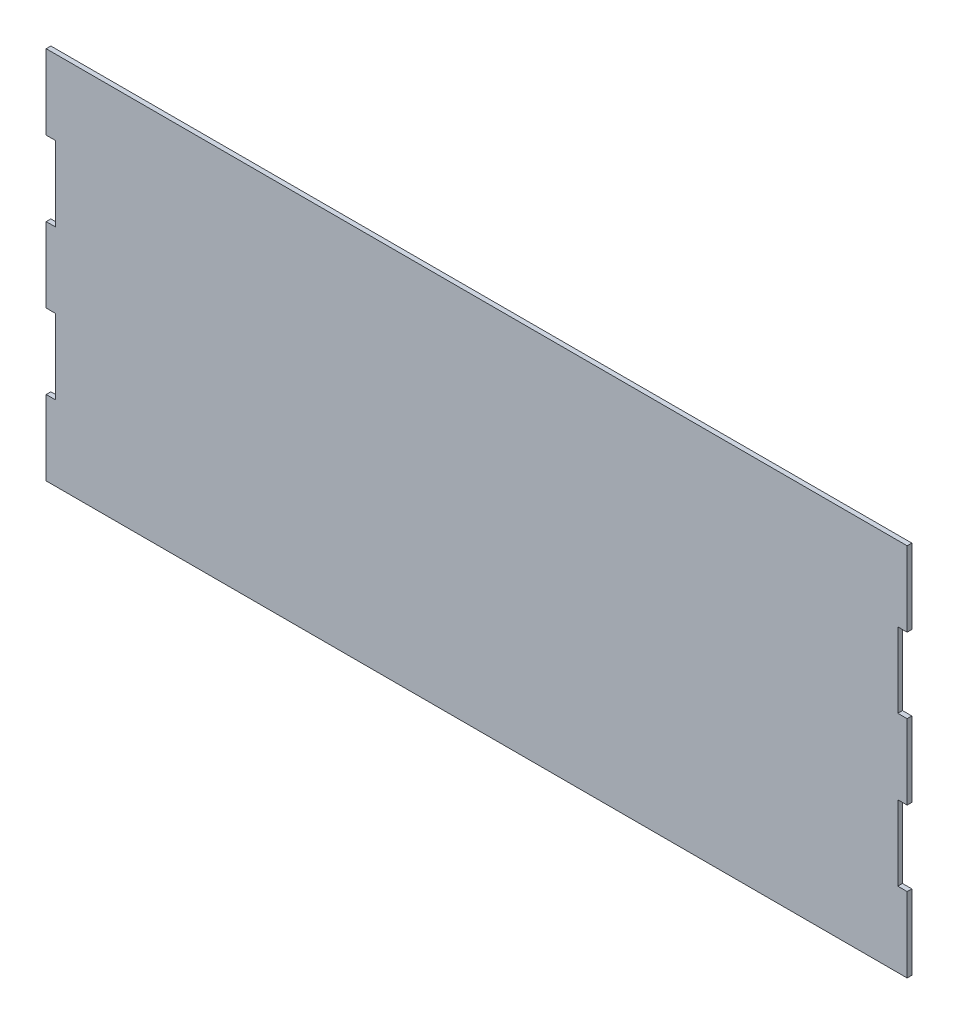
ISO-10303-21;
HEADER;
FILE_DESCRIPTION(('STEP AP214'),'2;1');
FILE_NAME('part.step','',(''),(''),'','','');
FILE_SCHEMA(('AUTOMOTIVE_DESIGN { 1 0 10303 214 1 1 1 1 }'));
ENDSEC;
DATA;
#1=APPLICATION_CONTEXT('core data for automotive mechanical design processes');
#2=APPLICATION_PROTOCOL_DEFINITION('international standard','automotive_design',2000,#1);
#3=PRODUCT_CONTEXT('',#1,'mechanical');
#4=PRODUCT('Part','Part','',(#3));
#5=PRODUCT_RELATED_PRODUCT_CATEGORY('part','',(#4));
#6=PRODUCT_DEFINITION_FORMATION('','',#4);
#7=PRODUCT_DEFINITION_CONTEXT('part definition',#1,'design');
#8=PRODUCT_DEFINITION('design','',#6,#7);
#9=PRODUCT_DEFINITION_SHAPE('','',#8);
#10=(LENGTH_UNIT() NAMED_UNIT(*) SI_UNIT(.MILLI.,.METRE.));
#11=(NAMED_UNIT(*) PLANE_ANGLE_UNIT() SI_UNIT($,.RADIAN.));
#12=(NAMED_UNIT(*) SI_UNIT($,.STERADIAN.) SOLID_ANGLE_UNIT());
#13=UNCERTAINTY_MEASURE_WITH_UNIT(LENGTH_MEASURE(1.E-05),#10,'distance_accuracy_value','');
#14=(GEOMETRIC_REPRESENTATION_CONTEXT(3) GLOBAL_UNCERTAINTY_ASSIGNED_CONTEXT((#13)) GLOBAL_UNIT_ASSIGNED_CONTEXT((#10,
#11,#12)) REPRESENTATION_CONTEXT('',''));
#15=CARTESIAN_POINT('',(0.,0.,0.));
#16=DIRECTION('',(0.,0.,1.));
#17=DIRECTION('',(1.,0.,0.));
#18=AXIS2_PLACEMENT_3D('',#15,#16,#17);
#19=CARTESIAN_POINT('',(0.,101.6,3.175));
#20=DIRECTION('',(0.,-1.,0.));
#21=DIRECTION('',(0.,0.,-1.));
#22=AXIS2_PLACEMENT_3D('',#19,#20,#21);
#23=PLANE('',#22);
#24=DIRECTION('',(-1.,0.,0.));
#25=VECTOR('',#24,1.);
#26=CARTESIAN_POINT('',(0.,101.6,0.));
#27=LINE('',#26,#25);
#28=CARTESIAN_POINT('',(584.199999999999,101.6,0.));
#29=VERTEX_POINT('',#28);
#30=CARTESIAN_POINT('',(577.849999999999,101.6,0.));
#31=VERTEX_POINT('',#30);
#32=EDGE_CURVE('E203',#29,#31,#27,.T.);
#33=ORIENTED_EDGE('',*,*,#32,.F.);
#34=DIRECTION('',(0.,0.,-1.));
#35=VECTOR('',#34,1.);
#36=CARTESIAN_POINT('',(584.199999999999,101.6,3.175));
#37=LINE('',#36,#35);
#38=CARTESIAN_POINT('',(584.199999999999,101.6,3.175));
#39=VERTEX_POINT('',#38);
#40=EDGE_CURVE('E11',#39,#29,#37,.T.);
#41=ORIENTED_EDGE('',*,*,#40,.F.);
#42=DIRECTION('',(-1.,0.,0.));
#43=VECTOR('',#42,1.);
#44=CARTESIAN_POINT('',(0.,101.6,3.175));
#45=LINE('',#44,#43);
#46=CARTESIAN_POINT('',(577.849999999999,101.6,3.175));
#47=VERTEX_POINT('',#46);
#48=EDGE_CURVE('E254',#39,#47,#45,.T.);
#49=ORIENTED_EDGE('',*,*,#48,.T.);
#50=DIRECTION('',(0.,0.,-1.));
#51=VECTOR('',#50,1.);
#52=CARTESIAN_POINT('',(577.849999999999,101.6,3.175));
#53=LINE('',#52,#51);
#54=EDGE_CURVE('E52',#47,#31,#53,.T.);
#55=ORIENTED_EDGE('',*,*,#54,.T.);
#56=EDGE_LOOP('',(#33,#41,#49,#55));
#57=FACE_BOUND('',#56,.T.);
#58=ADVANCED_FACE('F36',(#57),#23,.T.);
#59=CARTESIAN_POINT('',(584.199999999997,-1.14908083048703E-11,3.175));
#60=DIRECTION('',(-1.,0.,0.));
#61=DIRECTION('',(0.,-1.,0.));
#62=AXIS2_PLACEMENT_3D('',#59,#60,#61);
#63=PLANE('',#62);
#64=DIRECTION('',(0.,1.,0.));
#65=VECTOR('',#64,1.);
#66=CARTESIAN_POINT('',(584.199999999997,-1.14908083048703E-11,0.));
#67=LINE('',#66,#65);
#68=CARTESIAN_POINT('',(584.2,152.4,0.));
#69=VERTEX_POINT('',#68);
#70=EDGE_CURVE('E205',#29,#69,#67,.T.);
#71=ORIENTED_EDGE('',*,*,#70,.T.);
#72=DIRECTION('',(0.,0.,-1.));
#73=VECTOR('',#72,1.);
#74=CARTESIAN_POINT('',(584.2,152.4,3.175));
#75=LINE('',#74,#73);
#76=CARTESIAN_POINT('',(584.2,152.4,3.175));
#77=VERTEX_POINT('',#76);
#78=EDGE_CURVE('E44',#77,#69,#75,.T.);
#79=ORIENTED_EDGE('',*,*,#78,.F.);
#80=DIRECTION('',(0.,1.,0.));
#81=VECTOR('',#80,1.);
#82=CARTESIAN_POINT('',(584.199999999997,-1.14908083048703E-11,3.175));
#83=LINE('',#82,#81);
#84=EDGE_CURVE('E311',#39,#77,#83,.T.);
#85=ORIENTED_EDGE('',*,*,#84,.F.);
#86=ORIENTED_EDGE('',*,*,#40,.T.);
#87=EDGE_LOOP('',(#71,#79,#85,#86));
#88=FACE_BOUND('',#87,.T.);
#89=ADVANCED_FACE('F298',(#88),#63,.F.);
#90=CARTESIAN_POINT('',(0.,152.4,3.175));
#91=DIRECTION('',(0.,1.,0.));
#92=DIRECTION('',(0.,0.,1.));
#93=AXIS2_PLACEMENT_3D('',#90,#91,#92);
#94=PLANE('',#93);
#95=DIRECTION('',(1.,0.,0.));
#96=VECTOR('',#95,1.);
#97=CARTESIAN_POINT('',(0.,152.4,0.));
#98=LINE('',#97,#96);
#99=CARTESIAN_POINT('',(577.85,152.4,0.));
#100=VERTEX_POINT('',#99);
#101=EDGE_CURVE('E208',#100,#69,#98,.T.);
#102=ORIENTED_EDGE('',*,*,#101,.F.);
#103=DIRECTION('',(0.,0.,-1.));
#104=VECTOR('',#103,1.);
#105=CARTESIAN_POINT('',(577.85,152.4,3.175));
#106=LINE('',#105,#104);
#107=CARTESIAN_POINT('',(577.85,152.4,3.175));
#108=VERTEX_POINT('',#107);
#109=EDGE_CURVE('E288',#108,#100,#106,.T.);
#110=ORIENTED_EDGE('',*,*,#109,.F.);
#111=DIRECTION('',(1.,0.,0.));
#112=VECTOR('',#111,1.);
#113=CARTESIAN_POINT('',(0.,152.4,3.175));
#114=LINE('',#113,#112);
#115=EDGE_CURVE('E295',#108,#77,#114,.T.);
#116=ORIENTED_EDGE('',*,*,#115,.T.);
#117=ORIENTED_EDGE('',*,*,#78,.T.);
#118=EDGE_LOOP('',(#102,#110,#116,#117));
#119=FACE_BOUND('',#118,.T.);
#120=ADVANCED_FACE('F293',(#119),#94,.T.);
#121=CARTESIAN_POINT('',(577.85,0.,3.175));
#122=DIRECTION('',(1.,0.,0.));
#123=DIRECTION('',(0.,0.,-1.));
#124=AXIS2_PLACEMENT_3D('',#121,#122,#123);
#125=PLANE('',#124);
#126=DIRECTION('',(0.,-1.,0.));
#127=VECTOR('',#126,1.);
#128=CARTESIAN_POINT('',(577.85,0.,0.));
#129=LINE('',#128,#127);
#130=CARTESIAN_POINT('',(577.85,203.2,0.));
#131=VERTEX_POINT('',#130);
#132=EDGE_CURVE('E211',#131,#100,#129,.T.);
#133=ORIENTED_EDGE('',*,*,#132,.F.);
#134=DIRECTION('',(0.,0.,-1.));
#135=VECTOR('',#134,1.);
#136=CARTESIAN_POINT('',(577.85,203.2,3.175));
#137=LINE('',#136,#135);
#138=CARTESIAN_POINT('',(577.85,203.2,3.175));
#139=VERTEX_POINT('',#138);
#140=EDGE_CURVE('E286',#139,#131,#137,.T.);
#141=ORIENTED_EDGE('',*,*,#140,.F.);
#142=DIRECTION('',(0.,-1.,0.));
#143=VECTOR('',#142,1.);
#144=CARTESIAN_POINT('',(577.85,0.,3.175));
#145=LINE('',#144,#143);
#146=EDGE_CURVE('E308',#139,#108,#145,.T.);
#147=ORIENTED_EDGE('',*,*,#146,.T.);
#148=ORIENTED_EDGE('',*,*,#109,.T.);
#149=EDGE_LOOP('',(#133,#141,#147,#148));
#150=FACE_BOUND('',#149,.T.);
#151=ADVANCED_FACE('F305',(#150),#125,.T.);
#152=CARTESIAN_POINT('',(0.,203.2,3.175));
#153=DIRECTION('',(0.,-1.,0.));
#154=DIRECTION('',(0.,0.,-1.));
#155=AXIS2_PLACEMENT_3D('',#152,#153,#154);
#156=PLANE('',#155);
#157=DIRECTION('',(-1.,0.,0.));
#158=VECTOR('',#157,1.);
#159=CARTESIAN_POINT('',(0.,203.2,0.));
#160=LINE('',#159,#158);
#161=CARTESIAN_POINT('',(584.2,203.2,0.));
#162=VERTEX_POINT('',#161);
#163=EDGE_CURVE('E214',#162,#131,#160,.T.);
#164=ORIENTED_EDGE('',*,*,#163,.F.);
#165=DIRECTION('',(0.,0.,-1.));
#166=VECTOR('',#165,1.);
#167=CARTESIAN_POINT('',(584.2,203.2,3.175));
#168=LINE('',#167,#166);
#169=CARTESIAN_POINT('',(584.2,203.2,3.175));
#170=VERTEX_POINT('',#169);
#171=EDGE_CURVE('E284',#170,#162,#168,.T.);
#172=ORIENTED_EDGE('',*,*,#171,.F.);
#173=DIRECTION('',(-1.,0.,0.));
#174=VECTOR('',#173,1.);
#175=CARTESIAN_POINT('',(0.,203.2,3.175));
#176=LINE('',#175,#174);
#177=EDGE_CURVE('E313',#170,#139,#176,.T.);
#178=ORIENTED_EDGE('',*,*,#177,.T.);
#179=ORIENTED_EDGE('',*,*,#140,.T.);
#180=EDGE_LOOP('',(#164,#172,#178,#179));
#181=FACE_BOUND('',#180,.T.);
#182=ADVANCED_FACE('F512',(#181),#156,.T.);
#183=CARTESIAN_POINT('',(584.2,0.,3.175));
#184=DIRECTION('',(-1.,0.,0.));
#185=DIRECTION('',(0.,0.,1.));
#186=AXIS2_PLACEMENT_3D('',#183,#184,#185);
#187=PLANE('',#186);
#188=DIRECTION('',(0.,1.,0.));
#189=VECTOR('',#188,1.);
#190=CARTESIAN_POINT('',(584.2,0.,0.));
#191=LINE('',#190,#189);
#192=CARTESIAN_POINT('',(584.2,254.,0.));
#193=VERTEX_POINT('',#192);
#194=EDGE_CURVE('E217',#162,#193,#191,.T.);
#195=ORIENTED_EDGE('',*,*,#194,.T.);
#196=DIRECTION('',(0.,0.,-1.));
#197=VECTOR('',#196,1.);
#198=CARTESIAN_POINT('',(584.2,254.,3.175));
#199=LINE('',#198,#197);
#200=CARTESIAN_POINT('',(584.2,254.,3.175));
#201=VERTEX_POINT('',#200);
#202=EDGE_CURVE('E282',#201,#193,#199,.T.);
#203=ORIENTED_EDGE('',*,*,#202,.F.);
#204=DIRECTION('',(0.,1.,0.));
#205=VECTOR('',#204,1.);
#206=CARTESIAN_POINT('',(584.2,0.,3.175));
#207=LINE('',#206,#205);
#208=EDGE_CURVE('E319',#170,#201,#207,.T.);
#209=ORIENTED_EDGE('',*,*,#208,.F.);
#210=ORIENTED_EDGE('',*,*,#171,.T.);
#211=EDGE_LOOP('',(#195,#203,#209,#210));
#212=FACE_BOUND('',#211,.T.);
#213=ADVANCED_FACE('F502',(#212),#187,.F.);
#214=CARTESIAN_POINT('',(0.,254.,3.175));
#215=DIRECTION('',(0.,1.,0.));
#216=DIRECTION('',(-1.,0.,0.));
#217=AXIS2_PLACEMENT_3D('',#214,#215,#216);
#218=PLANE('',#217);
#219=DIRECTION('',(1.,0.,0.));
#220=VECTOR('',#219,1.);
#221=CARTESIAN_POINT('',(0.,254.,0.));
#222=LINE('',#221,#220);
#223=CARTESIAN_POINT('',(0.,254.,0.));
#224=VERTEX_POINT('',#223);
#225=EDGE_CURVE('E220',#224,#193,#222,.T.);
#226=ORIENTED_EDGE('',*,*,#225,.F.);
#227=DIRECTION('',(0.,0.,-1.));
#228=VECTOR('',#227,1.);
#229=CARTESIAN_POINT('',(0.,254.,3.175));
#230=LINE('',#229,#228);
#231=CARTESIAN_POINT('',(0.,254.,3.175));
#232=VERTEX_POINT('',#231);
#233=EDGE_CURVE('E280',#232,#224,#230,.T.);
#234=ORIENTED_EDGE('',*,*,#233,.F.);
#235=DIRECTION('',(1.,0.,0.));
#236=VECTOR('',#235,1.);
#237=CARTESIAN_POINT('',(0.,254.,3.175));
#238=LINE('',#237,#236);
#239=EDGE_CURVE('E321',#232,#201,#238,.T.);
#240=ORIENTED_EDGE('',*,*,#239,.T.);
#241=ORIENTED_EDGE('',*,*,#202,.T.);
#242=EDGE_LOOP('',(#226,#234,#240,#241));
#243=FACE_BOUND('',#242,.T.);
#244=ADVANCED_FACE('F492',(#243),#218,.T.);
#245=CARTESIAN_POINT('',(0.,0.,3.175));
#246=DIRECTION('',(-1.,0.,0.));
#247=DIRECTION('',(0.,0.,1.));
#248=AXIS2_PLACEMENT_3D('',#245,#246,#247);
#249=PLANE('',#248);
#250=DIRECTION('',(0.,1.,0.));
#251=VECTOR('',#250,1.);
#252=CARTESIAN_POINT('',(0.,0.,0.));
#253=LINE('',#252,#251);
#254=CARTESIAN_POINT('',(0.,203.2,0.));
#255=VERTEX_POINT('',#254);
#256=EDGE_CURVE('E223',#255,#224,#253,.T.);
#257=ORIENTED_EDGE('',*,*,#256,.F.);
#258=DIRECTION('',(0.,0.,-1.));
#259=VECTOR('',#258,1.);
#260=CARTESIAN_POINT('',(0.,203.2,3.175));
#261=LINE('',#260,#259);
#262=CARTESIAN_POINT('',(0.,203.2,3.175));
#263=VERTEX_POINT('',#262);
#264=EDGE_CURVE('E278',#263,#255,#261,.T.);
#265=ORIENTED_EDGE('',*,*,#264,.F.);
#266=DIRECTION('',(0.,1.,0.));
#267=VECTOR('',#266,1.);
#268=CARTESIAN_POINT('',(0.,0.,3.175));
#269=LINE('',#268,#267);
#270=EDGE_CURVE('E324',#263,#232,#269,.T.);
#271=ORIENTED_EDGE('',*,*,#270,.T.);
#272=ORIENTED_EDGE('',*,*,#233,.T.);
#273=EDGE_LOOP('',(#257,#265,#271,#272));
#274=FACE_BOUND('',#273,.T.);
#275=ADVANCED_FACE('F482',(#274),#249,.T.);
#276=CARTESIAN_POINT('',(0.,203.2,3.175));
#277=DIRECTION('',(0.,1.,0.));
#278=DIRECTION('',(0.,0.,1.));
#279=AXIS2_PLACEMENT_3D('',#276,#277,#278);
#280=PLANE('',#279);
#281=DIRECTION('',(1.,0.,0.));
#282=VECTOR('',#281,1.);
#283=CARTESIAN_POINT('',(0.,203.2,0.));
#284=LINE('',#283,#282);
#285=CARTESIAN_POINT('',(6.35,203.2,0.));
#286=VERTEX_POINT('',#285);
#287=EDGE_CURVE('E226',#255,#286,#284,.T.);
#288=ORIENTED_EDGE('',*,*,#287,.T.);
#289=DIRECTION('',(0.,0.,-1.));
#290=VECTOR('',#289,1.);
#291=CARTESIAN_POINT('',(6.35,203.2,3.175));
#292=LINE('',#291,#290);
#293=CARTESIAN_POINT('',(6.35,203.2,3.175));
#294=VERTEX_POINT('',#293);
#295=EDGE_CURVE('E275',#294,#286,#292,.T.);
#296=ORIENTED_EDGE('',*,*,#295,.F.);
#297=DIRECTION('',(1.,0.,0.));
#298=VECTOR('',#297,1.);
#299=CARTESIAN_POINT('',(0.,203.2,3.175));
#300=LINE('',#299,#298);
#301=EDGE_CURVE('E327',#263,#294,#300,.T.);
#302=ORIENTED_EDGE('',*,*,#301,.F.);
#303=ORIENTED_EDGE('',*,*,#264,.T.);
#304=EDGE_LOOP('',(#288,#296,#302,#303));
#305=FACE_BOUND('',#304,.T.);
#306=ADVANCED_FACE('F472',(#305),#280,.F.);
#307=CARTESIAN_POINT('',(6.35000000000002,0.,3.175));
#308=DIRECTION('',(1.,0.,0.));
#309=DIRECTION('',(0.,1.,0.));
#310=AXIS2_PLACEMENT_3D('',#307,#308,#309);
#311=PLANE('',#310);
#312=DIRECTION('',(0.,-1.,0.));
#313=VECTOR('',#312,1.);
#314=CARTESIAN_POINT('',(6.35000000000002,0.,0.));
#315=LINE('',#314,#313);
#316=CARTESIAN_POINT('',(6.35,152.4,0.));
#317=VERTEX_POINT('',#316);
#318=EDGE_CURVE('E228',#286,#317,#315,.T.);
#319=ORIENTED_EDGE('',*,*,#318,.T.);
#320=DIRECTION('',(0.,0.,-1.));
#321=VECTOR('',#320,1.);
#322=CARTESIAN_POINT('',(6.35,152.4,3.175));
#323=LINE('',#322,#321);
#324=CARTESIAN_POINT('',(6.35,152.4,3.175));
#325=VERTEX_POINT('',#324);
#326=EDGE_CURVE('E272',#325,#317,#323,.T.);
#327=ORIENTED_EDGE('',*,*,#326,.F.);
#328=DIRECTION('',(0.,-1.,0.));
#329=VECTOR('',#328,1.);
#330=CARTESIAN_POINT('',(6.35000000000002,0.,3.175));
#331=LINE('',#330,#329);
#332=EDGE_CURVE('E329',#294,#325,#331,.T.);
#333=ORIENTED_EDGE('',*,*,#332,.F.);
#334=ORIENTED_EDGE('',*,*,#295,.T.);
#335=EDGE_LOOP('',(#319,#327,#333,#334));
#336=FACE_BOUND('',#335,.T.);
#337=ADVANCED_FACE('F462',(#336),#311,.F.);
#338=CARTESIAN_POINT('',(0.,152.4,3.175));
#339=DIRECTION('',(0.,-1.,0.));
#340=DIRECTION('',(0.,0.,-1.));
#341=AXIS2_PLACEMENT_3D('',#338,#339,#340);
#342=PLANE('',#341);
#343=DIRECTION('',(-1.,0.,0.));
#344=VECTOR('',#343,1.);
#345=CARTESIAN_POINT('',(0.,152.4,0.));
#346=LINE('',#345,#344);
#347=CARTESIAN_POINT('',(0.,152.4,0.));
#348=VERTEX_POINT('',#347);
#349=EDGE_CURVE('E230',#317,#348,#346,.T.);
#350=ORIENTED_EDGE('',*,*,#349,.T.);
#351=DIRECTION('',(0.,0.,-1.));
#352=VECTOR('',#351,1.);
#353=CARTESIAN_POINT('',(0.,152.4,3.175));
#354=LINE('',#353,#352);
#355=CARTESIAN_POINT('',(0.,152.4,3.175));
#356=VERTEX_POINT('',#355);
#357=EDGE_CURVE('E270',#356,#348,#354,.T.);
#358=ORIENTED_EDGE('',*,*,#357,.F.);
#359=DIRECTION('',(-1.,0.,0.));
#360=VECTOR('',#359,1.);
#361=CARTESIAN_POINT('',(0.,152.4,3.175));
#362=LINE('',#361,#360);
#363=EDGE_CURVE('E331',#325,#356,#362,.T.);
#364=ORIENTED_EDGE('',*,*,#363,.F.);
#365=ORIENTED_EDGE('',*,*,#326,.T.);
#366=EDGE_LOOP('',(#350,#358,#364,#365));
#367=FACE_BOUND('',#366,.T.);
#368=ADVANCED_FACE('F452',(#367),#342,.F.);
#369=CARTESIAN_POINT('',(3.19261053623816E-12,0.,3.175));
#370=DIRECTION('',(-1.,0.,0.));
#371=DIRECTION('',(0.,-1.,0.));
#372=AXIS2_PLACEMENT_3D('',#369,#370,#371);
#373=PLANE('',#372);
#374=DIRECTION('',(0.,1.,0.));
#375=VECTOR('',#374,1.);
#376=CARTESIAN_POINT('',(3.19261053623816E-12,0.,0.));
#377=LINE('',#376,#375);
#378=CARTESIAN_POINT('',(1.06420351284259E-12,101.6,0.));
#379=VERTEX_POINT('',#378);
#380=EDGE_CURVE('E233',#379,#348,#377,.T.);
#381=ORIENTED_EDGE('',*,*,#380,.F.);
#382=DIRECTION('',(0.,0.,-1.));
#383=VECTOR('',#382,1.);
#384=CARTESIAN_POINT('',(1.06420351284259E-12,101.6,3.175));
#385=LINE('',#384,#383);
#386=CARTESIAN_POINT('',(1.06420351284259E-12,101.6,3.175));
#387=VERTEX_POINT('',#386);
#388=EDGE_CURVE('E268',#387,#379,#385,.T.);
#389=ORIENTED_EDGE('',*,*,#388,.F.);
#390=DIRECTION('',(0.,1.,0.));
#391=VECTOR('',#390,1.);
#392=CARTESIAN_POINT('',(3.19261053623816E-12,0.,3.175));
#393=LINE('',#392,#391);
#394=EDGE_CURVE('E333',#387,#356,#393,.T.);
#395=ORIENTED_EDGE('',*,*,#394,.T.);
#396=ORIENTED_EDGE('',*,*,#357,.T.);
#397=EDGE_LOOP('',(#381,#389,#395,#396));
#398=FACE_BOUND('',#397,.T.);
#399=ADVANCED_FACE('F442',(#398),#373,.T.);
#400=CARTESIAN_POINT('',(0.,101.6,3.175));
#401=DIRECTION('',(0.,1.,0.));
#402=DIRECTION('',(0.,0.,1.));
#403=AXIS2_PLACEMENT_3D('',#400,#401,#402);
#404=PLANE('',#403);
#405=DIRECTION('',(1.,0.,0.));
#406=VECTOR('',#405,1.);
#407=CARTESIAN_POINT('',(0.,101.6,0.));
#408=LINE('',#407,#406);
#409=CARTESIAN_POINT('',(6.35000000000106,101.6,0.));
#410=VERTEX_POINT('',#409);
#411=EDGE_CURVE('E236',#379,#410,#408,.T.);
#412=ORIENTED_EDGE('',*,*,#411,.T.);
#413=DIRECTION('',(0.,0.,-1.));
#414=VECTOR('',#413,1.);
#415=CARTESIAN_POINT('',(6.35000000000106,101.6,3.175));
#416=LINE('',#415,#414);
#417=CARTESIAN_POINT('',(6.35000000000106,101.6,3.175));
#418=VERTEX_POINT('',#417);
#419=EDGE_CURVE('E265',#418,#410,#416,.T.);
#420=ORIENTED_EDGE('',*,*,#419,.F.);
#421=DIRECTION('',(1.,0.,0.));
#422=VECTOR('',#421,1.);
#423=CARTESIAN_POINT('',(0.,101.6,3.175));
#424=LINE('',#423,#422);
#425=EDGE_CURVE('E336',#387,#418,#424,.T.);
#426=ORIENTED_EDGE('',*,*,#425,.F.);
#427=ORIENTED_EDGE('',*,*,#388,.T.);
#428=EDGE_LOOP('',(#412,#420,#426,#427));
#429=FACE_BOUND('',#428,.T.);
#430=ADVANCED_FACE('F432',(#429),#404,.F.);
#431=CARTESIAN_POINT('',(6.35000000000107,0.,3.175));
#432=DIRECTION('',(1.,0.,0.));
#433=DIRECTION('',(0.,1.,0.));
#434=AXIS2_PLACEMENT_3D('',#431,#432,#433);
#435=PLANE('',#434);
#436=DIRECTION('',(0.,-1.,0.));
#437=VECTOR('',#436,1.);
#438=CARTESIAN_POINT('',(6.35000000000107,0.,0.));
#439=LINE('',#438,#437);
#440=CARTESIAN_POINT('',(6.35000000000107,50.8,0.));
#441=VERTEX_POINT('',#440);
#442=EDGE_CURVE('E238',#410,#441,#439,.T.);
#443=ORIENTED_EDGE('',*,*,#442,.T.);
#444=DIRECTION('',(0.,0.,-1.));
#445=VECTOR('',#444,1.);
#446=CARTESIAN_POINT('',(6.35000000000107,50.8,3.175));
#447=LINE('',#446,#445);
#448=CARTESIAN_POINT('',(6.35000000000107,50.8,3.175));
#449=VERTEX_POINT('',#448);
#450=EDGE_CURVE('E262',#449,#441,#447,.T.);
#451=ORIENTED_EDGE('',*,*,#450,.F.);
#452=DIRECTION('',(0.,-1.,0.));
#453=VECTOR('',#452,1.);
#454=CARTESIAN_POINT('',(6.35000000000107,0.,3.175));
#455=LINE('',#454,#453);
#456=EDGE_CURVE('E338',#418,#449,#455,.T.);
#457=ORIENTED_EDGE('',*,*,#456,.F.);
#458=ORIENTED_EDGE('',*,*,#419,.T.);
#459=EDGE_LOOP('',(#443,#451,#457,#458));
#460=FACE_BOUND('',#459,.T.);
#461=ADVANCED_FACE('F423',(#460),#435,.F.);
#462=CARTESIAN_POINT('',(0.,50.8,3.175));
#463=DIRECTION('',(0.,-1.,0.));
#464=DIRECTION('',(0.,0.,-1.));
#465=AXIS2_PLACEMENT_3D('',#462,#463,#464);
#466=PLANE('',#465);
#467=DIRECTION('',(-1.,0.,0.));
#468=VECTOR('',#467,1.);
#469=CARTESIAN_POINT('',(0.,50.8,0.));
#470=LINE('',#469,#468);
#471=CARTESIAN_POINT('',(1.06420351207939E-12,50.8,0.));
#472=VERTEX_POINT('',#471);
#473=EDGE_CURVE('E240',#441,#472,#470,.T.);
#474=ORIENTED_EDGE('',*,*,#473,.T.);
#475=DIRECTION('',(0.,0.,-1.));
#476=VECTOR('',#475,1.);
#477=CARTESIAN_POINT('',(1.06420351207939E-12,50.8,3.175));
#478=LINE('',#477,#476);
#479=CARTESIAN_POINT('',(1.06420351207939E-12,50.8,3.175));
#480=VERTEX_POINT('',#479);
#481=EDGE_CURVE('E260',#480,#472,#478,.T.);
#482=ORIENTED_EDGE('',*,*,#481,.F.);
#483=DIRECTION('',(-1.,0.,0.));
#484=VECTOR('',#483,1.);
#485=CARTESIAN_POINT('',(0.,50.8,3.175));
#486=LINE('',#485,#484);
#487=EDGE_CURVE('E340',#449,#480,#486,.T.);
#488=ORIENTED_EDGE('',*,*,#487,.F.);
#489=ORIENTED_EDGE('',*,*,#450,.T.);
#490=EDGE_LOOP('',(#474,#482,#488,#489));
#491=FACE_BOUND('',#490,.T.);
#492=ADVANCED_FACE('F352',(#491),#466,.F.);
#493=CARTESIAN_POINT('',(0.,0.,3.175));
#494=DIRECTION('',(-1.,0.,0.));
#495=DIRECTION('',(0.,-1.,0.));
#496=AXIS2_PLACEMENT_3D('',#493,#494,#495);
#497=PLANE('',#496);
#498=DIRECTION('',(0.,1.,0.));
#499=VECTOR('',#498,1.);
#500=CARTESIAN_POINT('',(0.,0.,0.));
#501=LINE('',#500,#499);
#502=CARTESIAN_POINT('',(0.,0.,0.));
#503=VERTEX_POINT('',#502);
#504=EDGE_CURVE('E243',#503,#472,#501,.T.);
#505=ORIENTED_EDGE('',*,*,#504,.F.);
#506=DIRECTION('',(0.,0.,-1.));
#507=VECTOR('',#506,1.);
#508=CARTESIAN_POINT('',(0.,0.,3.175));
#509=LINE('',#508,#507);
#510=CARTESIAN_POINT('',(0.,0.,3.175));
#511=VERTEX_POINT('',#510);
#512=EDGE_CURVE('E258',#511,#503,#509,.T.);
#513=ORIENTED_EDGE('',*,*,#512,.F.);
#514=DIRECTION('',(0.,1.,0.));
#515=VECTOR('',#514,1.);
#516=CARTESIAN_POINT('',(0.,0.,3.175));
#517=LINE('',#516,#515);
#518=EDGE_CURVE('E342',#511,#480,#517,.T.);
#519=ORIENTED_EDGE('',*,*,#518,.T.);
#520=ORIENTED_EDGE('',*,*,#481,.T.);
#521=EDGE_LOOP('',(#505,#513,#519,#520));
#522=FACE_BOUND('',#521,.T.);
#523=ADVANCED_FACE('F346',(#522),#497,.T.);
#524=CARTESIAN_POINT('',(0.,0.,3.175));
#525=DIRECTION('',(0.,1.,0.));
#526=DIRECTION('',(-1.,0.,0.));
#527=AXIS2_PLACEMENT_3D('',#524,#525,#526);
#528=PLANE('',#527);
#529=DIRECTION('',(1.,0.,0.));
#530=VECTOR('',#529,1.);
#531=CARTESIAN_POINT('',(0.,0.,0.));
#532=LINE('',#531,#530);
#533=CARTESIAN_POINT('',(584.2,0.,0.));
#534=VERTEX_POINT('',#533);
#535=EDGE_CURVE('E246',#503,#534,#532,.T.);
#536=ORIENTED_EDGE('',*,*,#535,.T.);
#537=DIRECTION('',(0.,0.,-1.));
#538=VECTOR('',#537,1.);
#539=CARTESIAN_POINT('',(584.2,0.,3.175));
#540=LINE('',#539,#538);
#541=CARTESIAN_POINT('',(584.2,0.,3.175));
#542=VERTEX_POINT('',#541);
#543=EDGE_CURVE('E195',#542,#534,#540,.T.);
#544=ORIENTED_EDGE('',*,*,#543,.F.);
#545=DIRECTION('',(1.,0.,0.));
#546=VECTOR('',#545,1.);
#547=CARTESIAN_POINT('',(0.,0.,3.175));
#548=LINE('',#547,#546);
#549=EDGE_CURVE('E183',#511,#542,#548,.T.);
#550=ORIENTED_EDGE('',*,*,#549,.F.);
#551=ORIENTED_EDGE('',*,*,#512,.T.);
#552=EDGE_LOOP('',(#536,#544,#550,#551));
#553=FACE_BOUND('',#552,.T.);
#554=ADVANCED_FACE('F357',(#553),#528,.F.);
#555=CARTESIAN_POINT('',(584.2,1.27675647831893E-11,3.175));
#556=DIRECTION('',(-1.,0.,0.));
#557=DIRECTION('',(0.,-1.,0.));
#558=AXIS2_PLACEMENT_3D('',#555,#556,#557);
#559=PLANE('',#558);
#560=DIRECTION('',(0.,1.,0.));
#561=VECTOR('',#560,1.);
#562=CARTESIAN_POINT('',(584.2,1.27675647831893E-11,0.));
#563=LINE('',#562,#561);
#564=CARTESIAN_POINT('',(584.199999999999,50.8000000000001,0.));
#565=VERTEX_POINT('',#564);
#566=EDGE_CURVE('E192',#534,#565,#563,.T.);
#567=ORIENTED_EDGE('',*,*,#566,.T.);
#568=DIRECTION('',(0.,0.,-1.));
#569=VECTOR('',#568,1.);
#570=CARTESIAN_POINT('',(584.199999999999,50.8000000000001,3.175));
#571=LINE('',#570,#569);
#572=CARTESIAN_POINT('',(584.199999999999,50.8000000000001,3.175));
#573=VERTEX_POINT('',#572);
#574=EDGE_CURVE('E189',#573,#565,#571,.T.);
#575=ORIENTED_EDGE('',*,*,#574,.F.);
#576=DIRECTION('',(0.,1.,0.));
#577=VECTOR('',#576,1.);
#578=CARTESIAN_POINT('',(584.2,1.27675647831893E-11,3.175));
#579=LINE('',#578,#577);
#580=EDGE_CURVE('E174',#542,#573,#579,.T.);
#581=ORIENTED_EDGE('',*,*,#580,.F.);
#582=ORIENTED_EDGE('',*,*,#543,.T.);
#583=EDGE_LOOP('',(#567,#575,#581,#582));
#584=FACE_BOUND('',#583,.T.);
#585=ADVANCED_FACE('F190',(#584),#559,.F.);
#586=CARTESIAN_POINT('',(0.,50.8000000000001,3.175));
#587=DIRECTION('',(0.,1.,0.));
#588=DIRECTION('',(0.,0.,1.));
#589=AXIS2_PLACEMENT_3D('',#586,#587,#588);
#590=PLANE('',#589);
#591=DIRECTION('',(1.,0.,0.));
#592=VECTOR('',#591,1.);
#593=CARTESIAN_POINT('',(0.,50.8000000000001,0.));
#594=LINE('',#593,#592);
#595=CARTESIAN_POINT('',(577.849999999999,50.8000000000001,0.));
#596=VERTEX_POINT('',#595);
#597=EDGE_CURVE('E249',#596,#565,#594,.T.);
#598=ORIENTED_EDGE('',*,*,#597,.F.);
#599=DIRECTION('',(0.,0.,-1.));
#600=VECTOR('',#599,1.);
#601=CARTESIAN_POINT('',(577.849999999999,50.8000000000001,3.175));
#602=LINE('',#601,#600);
#603=CARTESIAN_POINT('',(577.849999999999,50.8000000000001,3.175));
#604=VERTEX_POINT('',#603);
#605=EDGE_CURVE('E113',#604,#596,#602,.T.);
#606=ORIENTED_EDGE('',*,*,#605,.F.);
#607=DIRECTION('',(1.,0.,0.));
#608=VECTOR('',#607,1.);
#609=CARTESIAN_POINT('',(0.,50.8000000000001,3.175));
#610=LINE('',#609,#608);
#611=EDGE_CURVE('E180',#604,#573,#610,.T.);
#612=ORIENTED_EDGE('',*,*,#611,.T.);
#613=ORIENTED_EDGE('',*,*,#574,.T.);
#614=EDGE_LOOP('',(#598,#606,#612,#613));
#615=FACE_BOUND('',#614,.T.);
#616=ADVANCED_FACE('F197',(#615),#590,.T.);
#617=CARTESIAN_POINT('',(577.849999999999,0.,3.175));
#618=DIRECTION('',(1.,0.,0.));
#619=DIRECTION('',(0.,0.,-1.));
#620=AXIS2_PLACEMENT_3D('',#617,#618,#619);
#621=PLANE('',#620);
#622=DIRECTION('',(0.,-1.,0.));
#623=VECTOR('',#622,1.);
#624=CARTESIAN_POINT('',(577.849999999999,0.,0.));
#625=LINE('',#624,#623);
#626=EDGE_CURVE('E251',#31,#596,#625,.T.);
#627=ORIENTED_EDGE('',*,*,#626,.F.);
#628=ORIENTED_EDGE('',*,*,#54,.F.);
#629=DIRECTION('',(0.,-1.,0.));
#630=VECTOR('',#629,1.);
#631=CARTESIAN_POINT('',(577.849999999999,0.,3.175));
#632=LINE('',#631,#630);
#633=EDGE_CURVE('E198',#47,#604,#632,.T.);
#634=ORIENTED_EDGE('',*,*,#633,.T.);
#635=ORIENTED_EDGE('',*,*,#605,.T.);
#636=EDGE_LOOP('',(#627,#628,#634,#635));
#637=FACE_BOUND('',#636,.T.);
#638=ADVANCED_FACE('F370',(#637),#621,.T.);
#639=CARTESIAN_POINT('',(0.,0.,3.175));
#640=DIRECTION('',(0.,0.,1.));
#641=DIRECTION('',(1.,0.,0.));
#642=AXIS2_PLACEMENT_3D('',#639,#640,#641);
#643=PLANE('',#642);
#644=ORIENTED_EDGE('',*,*,#48,.F.);
#645=ORIENTED_EDGE('',*,*,#84,.T.);
#646=ORIENTED_EDGE('',*,*,#115,.F.);
#647=ORIENTED_EDGE('',*,*,#146,.F.);
#648=ORIENTED_EDGE('',*,*,#177,.F.);
#649=ORIENTED_EDGE('',*,*,#208,.T.);
#650=ORIENTED_EDGE('',*,*,#239,.F.);
#651=ORIENTED_EDGE('',*,*,#270,.F.);
#652=ORIENTED_EDGE('',*,*,#301,.T.);
#653=ORIENTED_EDGE('',*,*,#332,.T.);
#654=ORIENTED_EDGE('',*,*,#363,.T.);
#655=ORIENTED_EDGE('',*,*,#394,.F.);
#656=ORIENTED_EDGE('',*,*,#425,.T.);
#657=ORIENTED_EDGE('',*,*,#456,.T.);
#658=ORIENTED_EDGE('',*,*,#487,.T.);
#659=ORIENTED_EDGE('',*,*,#518,.F.);
#660=ORIENTED_EDGE('',*,*,#549,.T.);
#661=ORIENTED_EDGE('',*,*,#580,.T.);
#662=ORIENTED_EDGE('',*,*,#611,.F.);
#663=ORIENTED_EDGE('',*,*,#633,.F.);
#664=EDGE_LOOP('',(#644,#645,#646,#647,#648,#649,#650,#651,#652,#653,#654,#655,#656,#657,#658,
#659,#660,#661,#662,#663));
#665=FACE_BOUND('',#664,.T.);
#666=ADVANCED_FACE('F177',(#665),#643,.T.);
#667=CARTESIAN_POINT('',(0.,0.,0.));
#668=DIRECTION('',(0.,0.,1.));
#669=DIRECTION('',(1.,0.,0.));
#670=AXIS2_PLACEMENT_3D('',#667,#668,#669);
#671=PLANE('',#670);
#672=ORIENTED_EDGE('',*,*,#32,.T.);
#673=ORIENTED_EDGE('',*,*,#626,.T.);
#674=ORIENTED_EDGE('',*,*,#597,.T.);
#675=ORIENTED_EDGE('',*,*,#566,.F.);
#676=ORIENTED_EDGE('',*,*,#535,.F.);
#677=ORIENTED_EDGE('',*,*,#504,.T.);
#678=ORIENTED_EDGE('',*,*,#473,.F.);
#679=ORIENTED_EDGE('',*,*,#442,.F.);
#680=ORIENTED_EDGE('',*,*,#411,.F.);
#681=ORIENTED_EDGE('',*,*,#380,.T.);
#682=ORIENTED_EDGE('',*,*,#349,.F.);
#683=ORIENTED_EDGE('',*,*,#318,.F.);
#684=ORIENTED_EDGE('',*,*,#287,.F.);
#685=ORIENTED_EDGE('',*,*,#256,.T.);
#686=ORIENTED_EDGE('',*,*,#225,.T.);
#687=ORIENTED_EDGE('',*,*,#194,.F.);
#688=ORIENTED_EDGE('',*,*,#163,.T.);
#689=ORIENTED_EDGE('',*,*,#132,.T.);
#690=ORIENTED_EDGE('',*,*,#101,.T.);
#691=ORIENTED_EDGE('',*,*,#70,.F.);
#692=EDGE_LOOP('',(#672,#673,#674,#675,#676,#677,#678,#679,#680,#681,#682,#683,#684,#685,#686,
#687,#688,#689,#690,#691));
#693=FACE_BOUND('',#692,.T.);
#694=ADVANCED_FACE('F300',(#693),#671,.F.);
#695=CLOSED_SHELL('',(#58,#89,#120,#151,#182,#213,#244,#275,#306,#337,#368,#399,#430,#461,#492,
#523,#554,#585,#616,#638,#666,#694));
#696=MANIFOLD_SOLID_BREP('B2',#695);
#697=ADVANCED_BREP_SHAPE_REPRESENTATION('',(#18,#696),#14);
#698=SHAPE_DEFINITION_REPRESENTATION(#9,#697);
ENDSEC;
END-ISO-10303-21;
